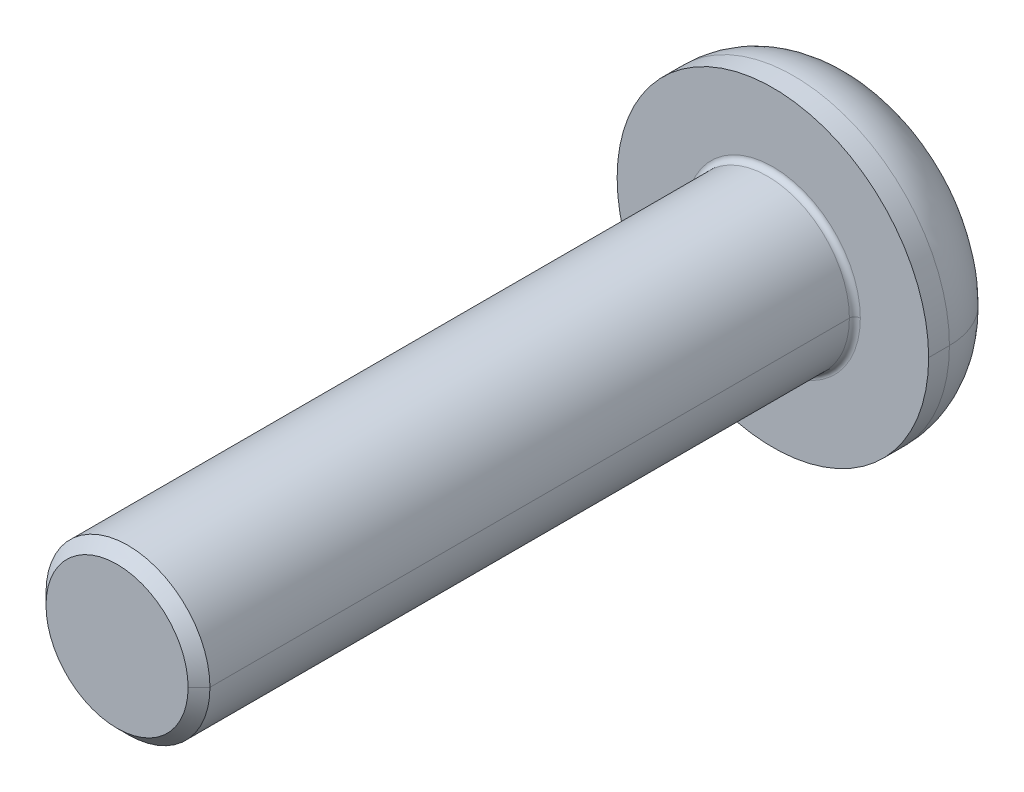
ISO-10303-21;
HEADER;
FILE_DESCRIPTION(('STEP AP214'),'2;1');
FILE_NAME('part.step','',(''),(''),'','','');
FILE_SCHEMA(('AUTOMOTIVE_DESIGN { 1 0 10303 214 1 1 1 1 }'));
ENDSEC;
DATA;
#1=APPLICATION_CONTEXT('core data for automotive mechanical design processes');
#2=APPLICATION_PROTOCOL_DEFINITION('international standard','automotive_design',2000,#1);
#3=PRODUCT_CONTEXT('',#1,'mechanical');
#4=PRODUCT('Part','Part','',(#3));
#5=PRODUCT_RELATED_PRODUCT_CATEGORY('part','',(#4));
#6=PRODUCT_DEFINITION_FORMATION('','',#4);
#7=PRODUCT_DEFINITION_CONTEXT('part definition',#1,'design');
#8=PRODUCT_DEFINITION('design','',#6,#7);
#9=PRODUCT_DEFINITION_SHAPE('','',#8);
#10=(LENGTH_UNIT() NAMED_UNIT(*) SI_UNIT(.MILLI.,.METRE.));
#11=(NAMED_UNIT(*) PLANE_ANGLE_UNIT() SI_UNIT($,.RADIAN.));
#12=(NAMED_UNIT(*) SI_UNIT($,.STERADIAN.) SOLID_ANGLE_UNIT());
#13=UNCERTAINTY_MEASURE_WITH_UNIT(LENGTH_MEASURE(1.E-05),#10,'distance_accuracy_value','');
#14=(GEOMETRIC_REPRESENTATION_CONTEXT(3) GLOBAL_UNCERTAINTY_ASSIGNED_CONTEXT((#13)) GLOBAL_UNIT_ASSIGNED_CONTEXT((#10,
#11,#12)) REPRESENTATION_CONTEXT('',''));
#15=CARTESIAN_POINT('',(0.,0.,0.));
#16=DIRECTION('',(0.,0.,1.));
#17=DIRECTION('',(1.,0.,0.));
#18=AXIS2_PLACEMENT_3D('',#15,#16,#17);
#19=CARTESIAN_POINT('',(0.,0.,0.1));
#20=DIRECTION('',(0.,0.,-1.));
#21=DIRECTION('',(-1.,0.,0.));
#22=AXIS2_PLACEMENT_3D('',#19,#20,#21);
#23=TOROIDAL_SURFACE('',#22,1.6,0.1);
#24=CARTESIAN_POINT('',(1.6,0.,0.1));
#25=DIRECTION('',(0.,1.,0.));
#26=DIRECTION('',(-1.,0.,0.));
#27=AXIS2_PLACEMENT_3D('',#24,#25,#26);
#28=CIRCLE('',#27,0.1);
#29=CARTESIAN_POINT('',(1.6,0.,0.));
#30=VERTEX_POINT('',#29);
#31=CARTESIAN_POINT('',(1.5,0.,0.1));
#32=VERTEX_POINT('',#31);
#33=EDGE_CURVE('E307',#30,#32,#28,.T.);
#34=ORIENTED_EDGE('',*,*,#33,.F.);
#35=CARTESIAN_POINT('',(0.,0.,0.));
#36=DIRECTION('',(0.,0.,-1.));
#37=DIRECTION('',(-1.,0.,0.));
#38=AXIS2_PLACEMENT_3D('',#35,#36,#37);
#39=CIRCLE('',#38,1.6);
#40=CARTESIAN_POINT('',(-1.6,0.,0.));
#41=VERTEX_POINT('',#40);
#42=EDGE_CURVE('E228',#41,#30,#39,.T.);
#43=ORIENTED_EDGE('',*,*,#42,.F.);
#44=CARTESIAN_POINT('',(-1.6,0.,0.1));
#45=DIRECTION('',(0.,-1.,0.));
#46=DIRECTION('',(0.,0.,-1.));
#47=AXIS2_PLACEMENT_3D('',#44,#45,#46);
#48=CIRCLE('',#47,0.1);
#49=CARTESIAN_POINT('',(-1.5,0.,0.1));
#50=VERTEX_POINT('',#49);
#51=EDGE_CURVE('E318',#41,#50,#48,.T.);
#52=ORIENTED_EDGE('',*,*,#51,.T.);
#53=CARTESIAN_POINT('',(0.,0.,0.1));
#54=DIRECTION('',(0.,0.,1.));
#55=DIRECTION('',(-1.,0.,0.));
#56=AXIS2_PLACEMENT_3D('',#53,#54,#55);
#57=CIRCLE('',#56,1.5);
#58=EDGE_CURVE('E163',#32,#50,#57,.T.);
#59=ORIENTED_EDGE('',*,*,#58,.F.);
#60=EDGE_LOOP('',(#34,#43,#52,#59));
#61=FACE_BOUND('',#60,.T.);
#62=ADVANCED_FACE('F17',(#61),#23,.F.);
#63=CARTESIAN_POINT('',(0.,0.,-0.38));
#64=DIRECTION('',(0.,0.,-1.));
#65=DIRECTION('',(-1.,0.,0.));
#66=AXIS2_PLACEMENT_3D('',#63,#64,#65);
#67=TOROIDAL_SURFACE('',#66,1.58,1.27);
#68=CARTESIAN_POINT('',(1.58,0.,-0.38));
#69=DIRECTION('',(0.,1.,0.));
#70=DIRECTION('',(-1.,0.,0.));
#71=AXIS2_PLACEMENT_3D('',#68,#69,#70);
#72=CIRCLE('',#71,1.27);
#73=CARTESIAN_POINT('',(2.85,0.,-0.38));
#74=VERTEX_POINT('',#73);
#75=CARTESIAN_POINT('',(1.58,0.,-1.65));
#76=VERTEX_POINT('',#75);
#77=EDGE_CURVE('E340',#74,#76,#72,.T.);
#78=ORIENTED_EDGE('',*,*,#77,.F.);
#79=CARTESIAN_POINT('',(0.,0.,-0.38));
#80=DIRECTION('',(0.,0.,1.));
#81=DIRECTION('',(-1.,0.,0.));
#82=AXIS2_PLACEMENT_3D('',#79,#80,#81);
#83=CIRCLE('',#82,2.85);
#84=CARTESIAN_POINT('',(-2.85,0.,-0.38));
#85=VERTEX_POINT('',#84);
#86=EDGE_CURVE('E188',#85,#74,#83,.T.);
#87=ORIENTED_EDGE('',*,*,#86,.F.);
#88=CARTESIAN_POINT('',(-1.58,0.,-0.38));
#89=DIRECTION('',(0.,-1.,0.));
#90=DIRECTION('',(0.,0.,-1.));
#91=AXIS2_PLACEMENT_3D('',#88,#89,#90);
#92=CIRCLE('',#91,1.27);
#93=CARTESIAN_POINT('',(-1.58,0.,-1.65));
#94=VERTEX_POINT('',#93);
#95=EDGE_CURVE('E324',#85,#94,#92,.T.);
#96=ORIENTED_EDGE('',*,*,#95,.T.);
#97=CARTESIAN_POINT('',(0.,0.,-1.65));
#98=DIRECTION('',(0.,0.,-1.));
#99=DIRECTION('',(-1.,0.,0.));
#100=AXIS2_PLACEMENT_3D('',#97,#98,#99);
#101=CIRCLE('',#100,1.58);
#102=EDGE_CURVE('E199',#76,#94,#101,.T.);
#103=ORIENTED_EDGE('',*,*,#102,.F.);
#104=EDGE_LOOP('',(#78,#87,#96,#103));
#105=FACE_BOUND('',#104,.T.);
#106=ADVANCED_FACE('F299',(#105),#67,.T.);
#107=CARTESIAN_POINT('',(0.,0.,-0.61));
#108=DIRECTION('',(0.,0.,-1.));
#109=DIRECTION('',(0.,-1.,0.));
#110=AXIS2_PLACEMENT_3D('',#107,#108,#109);
#111=PLANE('',#110);
#112=DIRECTION('',(-1.,0.,0.));
#113=VECTOR('',#112,1.);
#114=CARTESIAN_POINT('',(0.577350269189626,-1.,-0.61));
#115=LINE('',#114,#113);
#116=CARTESIAN_POINT('',(0.577350269189626,-1.,-0.61));
#117=VERTEX_POINT('',#116);
#118=CARTESIAN_POINT('',(-0.577350269189626,-1.,-0.61));
#119=VERTEX_POINT('',#118);
#120=EDGE_CURVE('E234',#117,#119,#115,.T.);
#121=ORIENTED_EDGE('',*,*,#120,.T.);
#122=DIRECTION('',(-0.5,0.866025403784439,0.));
#123=VECTOR('',#122,1.);
#124=CARTESIAN_POINT('',(-0.577350269189626,-1.,-0.61));
#125=LINE('',#124,#123);
#126=CARTESIAN_POINT('',(-1.15470053837925,0.,-0.61));
#127=VERTEX_POINT('',#126);
#128=EDGE_CURVE('E11',#119,#127,#125,.T.);
#129=ORIENTED_EDGE('',*,*,#128,.T.);
#130=DIRECTION('',(0.5,0.866025403784439,0.));
#131=VECTOR('',#130,1.);
#132=CARTESIAN_POINT('',(-1.15470053837925,0.,-0.61));
#133=LINE('',#132,#131);
#134=CARTESIAN_POINT('',(-0.577350269189626,1.,-0.61));
#135=VERTEX_POINT('',#134);
#136=EDGE_CURVE('E44',#127,#135,#133,.T.);
#137=ORIENTED_EDGE('',*,*,#136,.T.);
#138=DIRECTION('',(1.,0.,0.));
#139=VECTOR('',#138,1.);
#140=CARTESIAN_POINT('',(-0.577350269189626,1.,-0.61));
#141=LINE('',#140,#139);
#142=CARTESIAN_POINT('',(0.577350269189626,1.,-0.61));
#143=VERTEX_POINT('',#142);
#144=EDGE_CURVE('E189',#135,#143,#141,.T.);
#145=ORIENTED_EDGE('',*,*,#144,.T.);
#146=DIRECTION('',(0.5,-0.866025403784439,0.));
#147=VECTOR('',#146,1.);
#148=CARTESIAN_POINT('',(0.577350269189626,1.,-0.61));
#149=LINE('',#148,#147);
#150=CARTESIAN_POINT('',(1.15470053837925,0.,-0.61));
#151=VERTEX_POINT('',#150);
#152=EDGE_CURVE('E244',#143,#151,#149,.T.);
#153=ORIENTED_EDGE('',*,*,#152,.T.);
#154=DIRECTION('',(-0.5,-0.866025403784439,0.));
#155=VECTOR('',#154,1.);
#156=CARTESIAN_POINT('',(1.15470053837925,0.,-0.61));
#157=LINE('',#156,#155);
#158=EDGE_CURVE('E238',#151,#117,#157,.T.);
#159=ORIENTED_EDGE('',*,*,#158,.T.);
#160=EDGE_LOOP('',(#121,#129,#137,#145,#153,#159));
#161=FACE_BOUND('',#160,.T.);
#162=ADVANCED_FACE('F272',(#161),#111,.T.);
#163=CARTESIAN_POINT('',(-0.577350269189626,-1.,-0.61));
#164=DIRECTION('',(-0.866025403784439,-0.5,0.));
#165=DIRECTION('',(-0.5,0.866025403784439,0.));
#166=AXIS2_PLACEMENT_3D('',#163,#164,#165);
#167=PLANE('',#166);
#168=DIRECTION('',(-0.5,0.866025403784439,0.));
#169=VECTOR('',#168,1.);
#170=CARTESIAN_POINT('',(-0.577350269189626,-1.,-1.65));
#171=LINE('',#170,#169);
#172=CARTESIAN_POINT('',(-0.577350269189626,-1.,-1.65));
#173=VERTEX_POINT('',#172);
#174=CARTESIAN_POINT('',(-1.15470053837925,0.,-1.65));
#175=VERTEX_POINT('',#174);
#176=EDGE_CURVE('E224',#173,#175,#171,.T.);
#177=ORIENTED_EDGE('',*,*,#176,.T.);
#178=DIRECTION('',(0.,0.,-1.));
#179=VECTOR('',#178,1.);
#180=CARTESIAN_POINT('',(-1.15470053837925,0.,-0.61));
#181=LINE('',#180,#179);
#182=EDGE_CURVE('E25',#127,#175,#181,.T.);
#183=ORIENTED_EDGE('',*,*,#182,.F.);
#184=ORIENTED_EDGE('',*,*,#128,.F.);
#185=DIRECTION('',(0.,0.,-1.));
#186=VECTOR('',#185,1.);
#187=CARTESIAN_POINT('',(-0.577350269189626,-1.,-0.61));
#188=LINE('',#187,#186);
#189=EDGE_CURVE('E231',#119,#173,#188,.T.);
#190=ORIENTED_EDGE('',*,*,#189,.T.);
#191=EDGE_LOOP('',(#177,#183,#184,#190));
#192=FACE_BOUND('',#191,.T.);
#193=ADVANCED_FACE('F259',(#192),#167,.F.);
#194=CARTESIAN_POINT('',(-1.15470053837925,0.,-0.61));
#195=DIRECTION('',(-0.866025403784439,0.5,0.));
#196=DIRECTION('',(0.,0.,1.));
#197=AXIS2_PLACEMENT_3D('',#194,#195,#196);
#198=PLANE('',#197);
#199=DIRECTION('',(0.5,0.866025403784439,0.));
#200=VECTOR('',#199,1.);
#201=CARTESIAN_POINT('',(-1.15470053837925,0.,-1.65));
#202=LINE('',#201,#200);
#203=CARTESIAN_POINT('',(-0.577350269189626,1.,-1.65));
#204=VERTEX_POINT('',#203);
#205=EDGE_CURVE('E220',#175,#204,#202,.T.);
#206=ORIENTED_EDGE('',*,*,#205,.T.);
#207=DIRECTION('',(0.,0.,-1.));
#208=VECTOR('',#207,1.);
#209=CARTESIAN_POINT('',(-0.577350269189626,1.,-0.61));
#210=LINE('',#209,#208);
#211=EDGE_CURVE('E192',#135,#204,#210,.T.);
#212=ORIENTED_EDGE('',*,*,#211,.F.);
#213=ORIENTED_EDGE('',*,*,#136,.F.);
#214=ORIENTED_EDGE('',*,*,#182,.T.);
#215=EDGE_LOOP('',(#206,#212,#213,#214));
#216=FACE_BOUND('',#215,.T.);
#217=ADVANCED_FACE('F254',(#216),#198,.F.);
#218=CARTESIAN_POINT('',(-0.577350269189626,1.,-0.61));
#219=DIRECTION('',(0.,1.,0.));
#220=DIRECTION('',(1.,0.,0.));
#221=AXIS2_PLACEMENT_3D('',#218,#219,#220);
#222=PLANE('',#221);
#223=DIRECTION('',(1.,0.,0.));
#224=VECTOR('',#223,1.);
#225=CARTESIAN_POINT('',(-0.577350269189626,1.,-1.65));
#226=LINE('',#225,#224);
#227=CARTESIAN_POINT('',(0.577350269189626,1.,-1.65));
#228=VERTEX_POINT('',#227);
#229=EDGE_CURVE('E214',#204,#228,#226,.T.);
#230=ORIENTED_EDGE('',*,*,#229,.T.);
#231=DIRECTION('',(0.,0.,-1.));
#232=VECTOR('',#231,1.);
#233=CARTESIAN_POINT('',(0.577350269189626,1.,-0.61));
#234=LINE('',#233,#232);
#235=EDGE_CURVE('E193',#143,#228,#234,.T.);
#236=ORIENTED_EDGE('',*,*,#235,.F.);
#237=ORIENTED_EDGE('',*,*,#144,.F.);
#238=ORIENTED_EDGE('',*,*,#211,.T.);
#239=EDGE_LOOP('',(#230,#236,#237,#238));
#240=FACE_BOUND('',#239,.T.);
#241=ADVANCED_FACE('F269',(#240),#222,.F.);
#242=CARTESIAN_POINT('',(0.577350269189626,1.,-0.61));
#243=DIRECTION('',(0.866025403784439,0.5,0.));
#244=DIRECTION('',(0.,0.,-1.));
#245=AXIS2_PLACEMENT_3D('',#242,#243,#244);
#246=PLANE('',#245);
#247=DIRECTION('',(0.5,-0.866025403784439,0.));
#248=VECTOR('',#247,1.);
#249=CARTESIAN_POINT('',(0.577350269189626,1.,-1.65));
#250=LINE('',#249,#248);
#251=CARTESIAN_POINT('',(1.15470053837925,0.,-1.65));
#252=VERTEX_POINT('',#251);
#253=EDGE_CURVE('E210',#228,#252,#250,.T.);
#254=ORIENTED_EDGE('',*,*,#253,.T.);
#255=DIRECTION('',(0.,0.,-1.));
#256=VECTOR('',#255,1.);
#257=CARTESIAN_POINT('',(1.15470053837925,0.,-0.61));
#258=LINE('',#257,#256);
#259=EDGE_CURVE('E241',#151,#252,#258,.T.);
#260=ORIENTED_EDGE('',*,*,#259,.F.);
#261=ORIENTED_EDGE('',*,*,#152,.F.);
#262=ORIENTED_EDGE('',*,*,#235,.T.);
#263=EDGE_LOOP('',(#254,#260,#261,#262));
#264=FACE_BOUND('',#263,.T.);
#265=ADVANCED_FACE('F277',(#264),#246,.F.);
#266=CARTESIAN_POINT('',(1.15470053837925,0.,-0.61));
#267=DIRECTION('',(0.866025403784439,-0.5,0.));
#268=DIRECTION('',(0.,0.,-1.));
#269=AXIS2_PLACEMENT_3D('',#266,#267,#268);
#270=PLANE('',#269);
#271=DIRECTION('',(-0.5,-0.866025403784439,0.));
#272=VECTOR('',#271,1.);
#273=CARTESIAN_POINT('',(1.15470053837925,0.,-1.65));
#274=LINE('',#273,#272);
#275=CARTESIAN_POINT('',(0.577350269189626,-1.,-1.65));
#276=VERTEX_POINT('',#275);
#277=EDGE_CURVE('E206',#252,#276,#274,.T.);
#278=ORIENTED_EDGE('',*,*,#277,.T.);
#279=DIRECTION('',(0.,0.,-1.));
#280=VECTOR('',#279,1.);
#281=CARTESIAN_POINT('',(0.577350269189626,-1.,-0.61));
#282=LINE('',#281,#280);
#283=EDGE_CURVE('E237',#117,#276,#282,.T.);
#284=ORIENTED_EDGE('',*,*,#283,.F.);
#285=ORIENTED_EDGE('',*,*,#158,.F.);
#286=ORIENTED_EDGE('',*,*,#259,.T.);
#287=EDGE_LOOP('',(#278,#284,#285,#286));
#288=FACE_BOUND('',#287,.T.);
#289=ADVANCED_FACE('F279',(#288),#270,.F.);
#290=CARTESIAN_POINT('',(0.577350269189626,-1.,-0.61));
#291=DIRECTION('',(0.,-1.,0.));
#292=DIRECTION('',(-1.,0.,0.));
#293=AXIS2_PLACEMENT_3D('',#290,#291,#292);
#294=PLANE('',#293);
#295=DIRECTION('',(-1.,0.,0.));
#296=VECTOR('',#295,1.);
#297=CARTESIAN_POINT('',(0.577350269189626,-1.,-1.65));
#298=LINE('',#297,#296);
#299=EDGE_CURVE('E202',#276,#173,#298,.T.);
#300=ORIENTED_EDGE('',*,*,#299,.T.);
#301=ORIENTED_EDGE('',*,*,#189,.F.);
#302=ORIENTED_EDGE('',*,*,#120,.F.);
#303=ORIENTED_EDGE('',*,*,#283,.T.);
#304=EDGE_LOOP('',(#300,#301,#302,#303));
#305=FACE_BOUND('',#304,.T.);
#306=ADVANCED_FACE('F284',(#305),#294,.F.);
#307=CARTESIAN_POINT('',(0.,0.,0.));
#308=DIRECTION('',(0.,0.,-1.));
#309=DIRECTION('',(0.,-1.,0.));
#310=AXIS2_PLACEMENT_3D('',#307,#308,#309);
#311=PLANE('',#310);
#312=ORIENTED_EDGE('',*,*,#42,.T.);
#313=CARTESIAN_POINT('',(0.,0.,0.));
#314=DIRECTION('',(0.,0.,-1.));
#315=DIRECTION('',(-1.,0.,0.));
#316=AXIS2_PLACEMENT_3D('',#313,#314,#315);
#317=CIRCLE('',#316,1.6);
#318=EDGE_CURVE('E314',#30,#41,#317,.T.);
#319=ORIENTED_EDGE('',*,*,#318,.T.);
#320=EDGE_LOOP('',(#312,#319));
#321=FACE_BOUND('',#320,.T.);
#322=CARTESIAN_POINT('',(0.,0.,0.));
#323=DIRECTION('',(0.,0.,-1.));
#324=DIRECTION('',(-1.,0.,0.));
#325=AXIS2_PLACEMENT_3D('',#322,#323,#324);
#326=CIRCLE('',#325,2.85);
#327=CARTESIAN_POINT('',(2.85,0.,0.));
#328=VERTEX_POINT('',#327);
#329=CARTESIAN_POINT('',(-2.85,0.,0.));
#330=VERTEX_POINT('',#329);
#331=EDGE_CURVE('E196',#328,#330,#326,.T.);
#332=ORIENTED_EDGE('',*,*,#331,.F.);
#333=CARTESIAN_POINT('',(0.,0.,0.));
#334=DIRECTION('',(0.,0.,-1.));
#335=DIRECTION('',(-1.,0.,0.));
#336=AXIS2_PLACEMENT_3D('',#333,#334,#335);
#337=CIRCLE('',#336,2.85);
#338=EDGE_CURVE('E350',#330,#328,#337,.T.);
#339=ORIENTED_EDGE('',*,*,#338,.F.);
#340=EDGE_LOOP('',(#332,#339));
#341=FACE_BOUND('',#340,.T.);
#342=ADVANCED_FACE('F286',(#321,#341),#311,.F.);
#343=CARTESIAN_POINT('',(0.,0.,-1.65));
#344=DIRECTION('',(0.,0.,-1.));
#345=DIRECTION('',(0.,-1.,0.));
#346=AXIS2_PLACEMENT_3D('',#343,#344,#345);
#347=PLANE('',#346);
#348=ORIENTED_EDGE('',*,*,#299,.F.);
#349=ORIENTED_EDGE('',*,*,#277,.F.);
#350=ORIENTED_EDGE('',*,*,#253,.F.);
#351=ORIENTED_EDGE('',*,*,#229,.F.);
#352=ORIENTED_EDGE('',*,*,#205,.F.);
#353=ORIENTED_EDGE('',*,*,#176,.F.);
#354=EDGE_LOOP('',(#348,#349,#350,#351,#352,#353));
#355=FACE_BOUND('',#354,.T.);
#356=CARTESIAN_POINT('',(0.,0.,-1.65));
#357=DIRECTION('',(0.,0.,-1.));
#358=DIRECTION('',(-1.,0.,0.));
#359=AXIS2_PLACEMENT_3D('',#356,#357,#358);
#360=CIRCLE('',#359,1.58);
#361=EDGE_CURVE('E329',#94,#76,#360,.T.);
#362=ORIENTED_EDGE('',*,*,#361,.T.);
#363=ORIENTED_EDGE('',*,*,#102,.T.);
#364=EDGE_LOOP('',(#362,#363));
#365=FACE_BOUND('',#364,.T.);
#366=ADVANCED_FACE('F263',(#355,#365),#347,.T.);
#367=CARTESIAN_POINT('',(0.,0.,-1.65));
#368=DIRECTION('',(0.,0.,1.));
#369=DIRECTION('',(1.,0.,0.));
#370=AXIS2_PLACEMENT_3D('',#367,#368,#369);
#371=CYLINDRICAL_SURFACE('',#370,2.85);
#372=DIRECTION('',(0.,0.,1.));
#373=VECTOR('',#372,1.);
#374=CARTESIAN_POINT('',(-2.85,0.,-1.65));
#375=LINE('',#374,#373);
#376=EDGE_CURVE('E328',#85,#330,#375,.T.);
#377=ORIENTED_EDGE('',*,*,#376,.F.);
#378=ORIENTED_EDGE('',*,*,#86,.T.);
#379=DIRECTION('',(0.,0.,1.));
#380=VECTOR('',#379,1.);
#381=CARTESIAN_POINT('',(2.85,0.,-1.65));
#382=LINE('',#381,#380);
#383=EDGE_CURVE('E353',#74,#328,#382,.T.);
#384=ORIENTED_EDGE('',*,*,#383,.T.);
#385=ORIENTED_EDGE('',*,*,#331,.T.);
#386=EDGE_LOOP('',(#377,#378,#384,#385));
#387=FACE_BOUND('',#386,.T.);
#388=ADVANCED_FACE('F371',(#387),#371,.T.);
#389=CARTESIAN_POINT('',(0.,0.,12.));
#390=DIRECTION('',(0.,0.,-1.));
#391=DIRECTION('',(-1.,0.,0.));
#392=AXIS2_PLACEMENT_3D('',#389,#390,#391);
#393=CONICAL_SURFACE('',#392,1.3,0.785398163397446);
#394=DIRECTION('',(0.707106781186546,0.,-0.707106781186549));
#395=VECTOR('',#394,1.);
#396=CARTESIAN_POINT('',(1.3,0.,12.));
#397=LINE('',#396,#395);
#398=CARTESIAN_POINT('',(1.3,0.,12.));
#399=VERTEX_POINT('',#398);
#400=CARTESIAN_POINT('',(1.5,0.,11.8));
#401=VERTEX_POINT('',#400);
#402=EDGE_CURVE('E176',#399,#401,#397,.T.);
#403=ORIENTED_EDGE('',*,*,#402,.F.);
#404=CARTESIAN_POINT('',(0.,0.,12.));
#405=DIRECTION('',(0.,0.,1.));
#406=DIRECTION('',(1.,0.,0.));
#407=AXIS2_PLACEMENT_3D('',#404,#405,#406);
#408=CIRCLE('',#407,1.3);
#409=CARTESIAN_POINT('',(-1.3,0.,12.));
#410=VERTEX_POINT('',#409);
#411=EDGE_CURVE('E156',#410,#399,#408,.T.);
#412=ORIENTED_EDGE('',*,*,#411,.F.);
#413=DIRECTION('',(-0.707106781186546,0.,-0.707106781186549));
#414=VECTOR('',#413,1.);
#415=CARTESIAN_POINT('',(-1.3,0.,12.));
#416=LINE('',#415,#414);
#417=CARTESIAN_POINT('',(-1.5,0.,11.8));
#418=VERTEX_POINT('',#417);
#419=EDGE_CURVE('E168',#410,#418,#416,.T.);
#420=ORIENTED_EDGE('',*,*,#419,.T.);
#421=CARTESIAN_POINT('',(0.,0.,11.8));
#422=DIRECTION('',(0.,0.,-1.));
#423=DIRECTION('',(1.,0.,0.));
#424=AXIS2_PLACEMENT_3D('',#421,#422,#423);
#425=CIRCLE('',#424,1.5);
#426=EDGE_CURVE('E143',#401,#418,#425,.T.);
#427=ORIENTED_EDGE('',*,*,#426,.F.);
#428=EDGE_LOOP('',(#403,#412,#420,#427));
#429=FACE_BOUND('',#428,.T.);
#430=ADVANCED_FACE('F169',(#429),#393,.T.);
#431=CARTESIAN_POINT('',(0.,0.,12.));
#432=DIRECTION('',(0.,0.,1.));
#433=DIRECTION('',(1.,0.,0.));
#434=AXIS2_PLACEMENT_3D('',#431,#432,#433);
#435=PLANE('',#434);
#436=ORIENTED_EDGE('',*,*,#411,.T.);
#437=CARTESIAN_POINT('',(0.,0.,12.));
#438=DIRECTION('',(0.,0.,1.));
#439=DIRECTION('',(1.,0.,0.));
#440=AXIS2_PLACEMENT_3D('',#437,#438,#439);
#441=CIRCLE('',#440,1.3);
#442=EDGE_CURVE('E183',#399,#410,#441,.T.);
#443=ORIENTED_EDGE('',*,*,#442,.T.);
#444=EDGE_LOOP('',(#436,#443));
#445=FACE_BOUND('',#444,.T.);
#446=ADVANCED_FACE('F363',(#445),#435,.T.);
#447=CARTESIAN_POINT('',(0.,0.,12.));
#448=DIRECTION('',(0.,0.,-1.));
#449=DIRECTION('',(-1.,0.,0.));
#450=AXIS2_PLACEMENT_3D('',#447,#448,#449);
#451=CYLINDRICAL_SURFACE('',#450,1.5);
#452=DIRECTION('',(0.,0.,-1.));
#453=VECTOR('',#452,1.);
#454=CARTESIAN_POINT('',(1.5,0.,12.));
#455=LINE('',#454,#453);
#456=EDGE_CURVE('E150',#401,#32,#455,.T.);
#457=ORIENTED_EDGE('',*,*,#456,.F.);
#458=ORIENTED_EDGE('',*,*,#426,.T.);
#459=DIRECTION('',(0.,0.,-1.));
#460=VECTOR('',#459,1.);
#461=CARTESIAN_POINT('',(-1.5,0.,12.));
#462=LINE('',#461,#460);
#463=EDGE_CURVE('E147',#418,#50,#462,.T.);
#464=ORIENTED_EDGE('',*,*,#463,.T.);
#465=CARTESIAN_POINT('',(0.,0.,0.1));
#466=DIRECTION('',(0.,0.,1.));
#467=DIRECTION('',(-1.,0.,0.));
#468=AXIS2_PLACEMENT_3D('',#465,#466,#467);
#469=CIRCLE('',#468,1.5);
#470=EDGE_CURVE('E313',#50,#32,#469,.T.);
#471=ORIENTED_EDGE('',*,*,#470,.T.);
#472=EDGE_LOOP('',(#457,#458,#464,#471));
#473=FACE_BOUND('',#472,.T.);
#474=ADVANCED_FACE('F145',(#473),#451,.T.);
#475=CARTESIAN_POINT('',(0.,0.,12.));
#476=DIRECTION('',(0.,0.,-1.));
#477=DIRECTION('',(-1.,0.,0.));
#478=AXIS2_PLACEMENT_3D('',#475,#476,#477);
#479=CYLINDRICAL_SURFACE('',#478,1.5);
#480=CARTESIAN_POINT('',(0.,0.,11.8));
#481=DIRECTION('',(0.,0.,-1.));
#482=DIRECTION('',(1.,0.,0.));
#483=AXIS2_PLACEMENT_3D('',#480,#481,#482);
#484=CIRCLE('',#483,1.5);
#485=EDGE_CURVE('E161',#418,#401,#484,.T.);
#486=ORIENTED_EDGE('',*,*,#485,.T.);
#487=ORIENTED_EDGE('',*,*,#456,.T.);
#488=ORIENTED_EDGE('',*,*,#58,.T.);
#489=ORIENTED_EDGE('',*,*,#463,.F.);
#490=EDGE_LOOP('',(#486,#487,#488,#489));
#491=FACE_BOUND('',#490,.T.);
#492=ADVANCED_FACE('F159',(#491),#479,.T.);
#493=CARTESIAN_POINT('',(0.,0.,12.));
#494=DIRECTION('',(0.,0.,-1.));
#495=DIRECTION('',(-1.,0.,0.));
#496=AXIS2_PLACEMENT_3D('',#493,#494,#495);
#497=CONICAL_SURFACE('',#496,1.3,0.785398163397446);
#498=ORIENTED_EDGE('',*,*,#442,.F.);
#499=ORIENTED_EDGE('',*,*,#402,.T.);
#500=ORIENTED_EDGE('',*,*,#485,.F.);
#501=ORIENTED_EDGE('',*,*,#419,.F.);
#502=EDGE_LOOP('',(#498,#499,#500,#501));
#503=FACE_BOUND('',#502,.T.);
#504=ADVANCED_FACE('F175',(#503),#497,.T.);
#505=CARTESIAN_POINT('',(0.,0.,-1.65));
#506=DIRECTION('',(0.,0.,1.));
#507=DIRECTION('',(1.,0.,0.));
#508=AXIS2_PLACEMENT_3D('',#505,#506,#507);
#509=CYLINDRICAL_SURFACE('',#508,2.85);
#510=CARTESIAN_POINT('',(0.,0.,-0.38));
#511=DIRECTION('',(0.,0.,1.));
#512=DIRECTION('',(-1.,0.,0.));
#513=AXIS2_PLACEMENT_3D('',#510,#511,#512);
#514=CIRCLE('',#513,2.85);
#515=EDGE_CURVE('E334',#74,#85,#514,.T.);
#516=ORIENTED_EDGE('',*,*,#515,.T.);
#517=ORIENTED_EDGE('',*,*,#376,.T.);
#518=ORIENTED_EDGE('',*,*,#338,.T.);
#519=ORIENTED_EDGE('',*,*,#383,.F.);
#520=EDGE_LOOP('',(#516,#517,#518,#519));
#521=FACE_BOUND('',#520,.T.);
#522=ADVANCED_FACE('F375',(#521),#509,.T.);
#523=CARTESIAN_POINT('',(0.,0.,-0.38));
#524=DIRECTION('',(0.,0.,-1.));
#525=DIRECTION('',(-1.,0.,0.));
#526=AXIS2_PLACEMENT_3D('',#523,#524,#525);
#527=TOROIDAL_SURFACE('',#526,1.58,1.27);
#528=ORIENTED_EDGE('',*,*,#515,.F.);
#529=ORIENTED_EDGE('',*,*,#77,.T.);
#530=ORIENTED_EDGE('',*,*,#361,.F.);
#531=ORIENTED_EDGE('',*,*,#95,.F.);
#532=EDGE_LOOP('',(#528,#529,#530,#531));
#533=FACE_BOUND('',#532,.T.);
#534=ADVANCED_FACE('F377',(#533),#527,.T.);
#535=CARTESIAN_POINT('',(0.,0.,0.1));
#536=DIRECTION('',(0.,0.,-1.));
#537=DIRECTION('',(-1.,0.,0.));
#538=AXIS2_PLACEMENT_3D('',#535,#536,#537);
#539=TOROIDAL_SURFACE('',#538,1.6,0.1);
#540=ORIENTED_EDGE('',*,*,#318,.F.);
#541=ORIENTED_EDGE('',*,*,#33,.T.);
#542=ORIENTED_EDGE('',*,*,#470,.F.);
#543=ORIENTED_EDGE('',*,*,#51,.F.);
#544=EDGE_LOOP('',(#540,#541,#542,#543));
#545=FACE_BOUND('',#544,.T.);
#546=ADVANCED_FACE('F317',(#545),#539,.F.);
#547=CLOSED_SHELL('',(#62,#106,#162,#193,#217,#241,#265,#289,#306,#342,#366,#388,#430,#446,#474,
#492,#504,#522,#534,#546));
#548=MANIFOLD_SOLID_BREP('B1',#547);
#549=ADVANCED_BREP_SHAPE_REPRESENTATION('',(#18,#548),#14);
#550=SHAPE_DEFINITION_REPRESENTATION(#9,#549);
ENDSEC;
END-ISO-10303-21;
